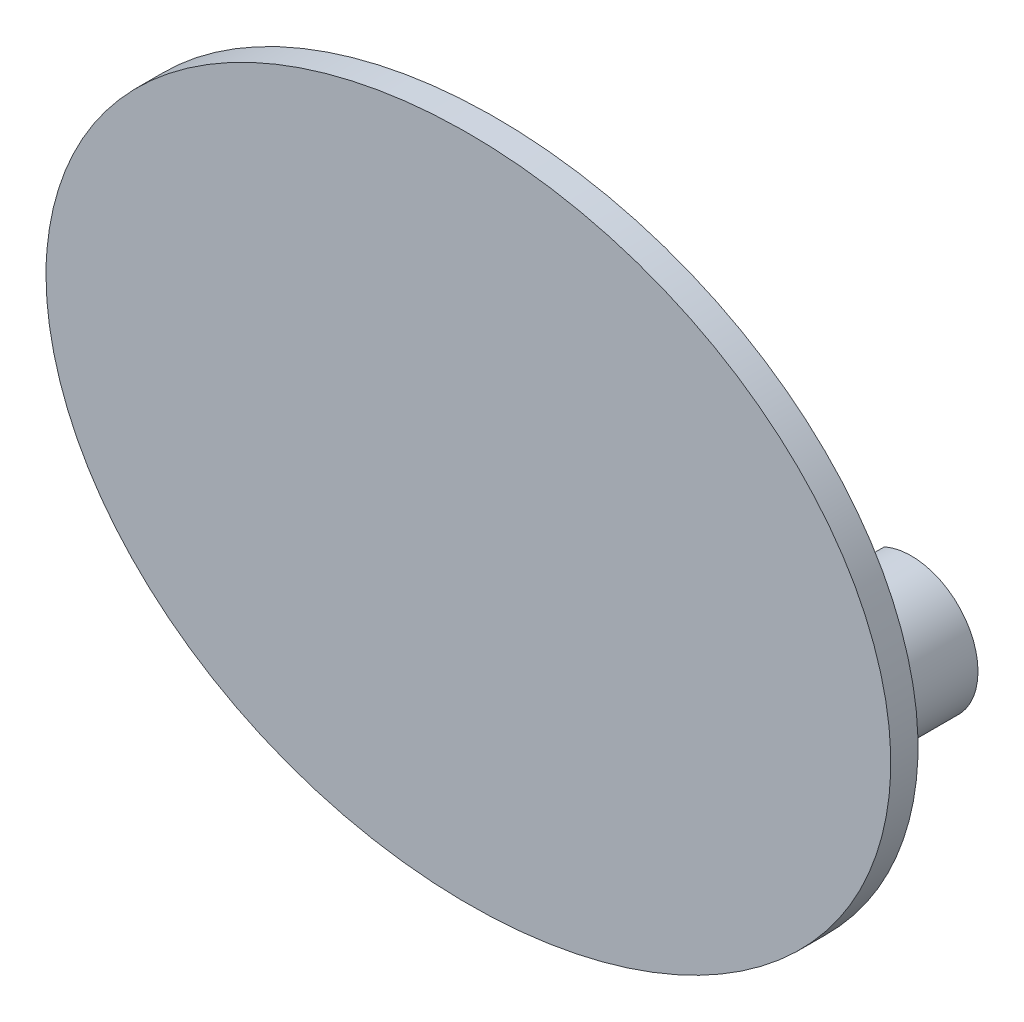
ISO-10303-21;
HEADER;
FILE_DESCRIPTION(('STEP AP214'),'2;1');
FILE_NAME('part.step','',(''),(''),'','','');
FILE_SCHEMA(('AUTOMOTIVE_DESIGN { 1 0 10303 214 1 1 1 1 }'));
ENDSEC;
DATA;
#1=APPLICATION_CONTEXT('core data for automotive mechanical design processes');
#2=APPLICATION_PROTOCOL_DEFINITION('international standard','automotive_design',2000,#1);
#3=PRODUCT_CONTEXT('',#1,'mechanical');
#4=PRODUCT('Part','Part','',(#3));
#5=PRODUCT_RELATED_PRODUCT_CATEGORY('part','',(#4));
#6=PRODUCT_DEFINITION_FORMATION('','',#4);
#7=PRODUCT_DEFINITION_CONTEXT('part definition',#1,'design');
#8=PRODUCT_DEFINITION('design','',#6,#7);
#9=PRODUCT_DEFINITION_SHAPE('','',#8);
#10=(LENGTH_UNIT() NAMED_UNIT(*) SI_UNIT(.MILLI.,.METRE.));
#11=(NAMED_UNIT(*) PLANE_ANGLE_UNIT() SI_UNIT($,.RADIAN.));
#12=(NAMED_UNIT(*) SI_UNIT($,.STERADIAN.) SOLID_ANGLE_UNIT());
#13=UNCERTAINTY_MEASURE_WITH_UNIT(LENGTH_MEASURE(1.E-05),#10,'distance_accuracy_value','');
#14=(GEOMETRIC_REPRESENTATION_CONTEXT(3) GLOBAL_UNCERTAINTY_ASSIGNED_CONTEXT((#13)) GLOBAL_UNIT_ASSIGNED_CONTEXT((#10,
#11,#12)) REPRESENTATION_CONTEXT('',''));
#15=CARTESIAN_POINT('',(0.,0.,0.));
#16=DIRECTION('',(0.,0.,1.));
#17=DIRECTION('',(1.,0.,0.));
#18=AXIS2_PLACEMENT_3D('',#15,#16,#17);
#19=CARTESIAN_POINT('',(0.,0.,-7.));
#20=DIRECTION('',(0.,0.,1.));
#21=DIRECTION('',(1.,0.,0.));
#22=AXIS2_PLACEMENT_3D('',#19,#20,#21);
#23=CYLINDRICAL_SURFACE('',#22,22.);
#24=DIRECTION('',(0.,0.,1.));
#25=VECTOR('',#24,1.);
#26=CARTESIAN_POINT('',(21.9863829787234,-0.773927330504451,-7.));
#27=LINE('',#26,#25);
#28=CARTESIAN_POINT('',(21.9863829787234,-0.773927330504452,-2.9));
#29=VERTEX_POINT('',#28);
#30=CARTESIAN_POINT('',(21.9863829787234,-0.773927330504452,0.));
#31=VERTEX_POINT('',#30);
#32=EDGE_CURVE('E362',#29,#31,#27,.T.);
#33=ORIENTED_EDGE('',*,*,#32,.F.);
#34=CARTESIAN_POINT('',(0.,0.,-2.9));
#35=DIRECTION('',(0.,0.,-1.));
#36=DIRECTION('',(-1.,0.,0.));
#37=AXIS2_PLACEMENT_3D('',#34,#35,#36);
#38=CIRCLE('',#37,22.);
#39=CARTESIAN_POINT('',(21.8080260454723,-2.89999999999999,-2.9));
#40=VERTEX_POINT('',#39);
#41=EDGE_CURVE('E270',#29,#40,#38,.T.);
#42=ORIENTED_EDGE('',*,*,#41,.T.);
#43=DIRECTION('',(0.,0.,1.));
#44=VECTOR('',#43,1.);
#45=CARTESIAN_POINT('',(21.8080260454723,-2.89999999999999,-7.));
#46=LINE('',#45,#44);
#47=CARTESIAN_POINT('',(21.8080260454723,-2.89999999999999,-5.4));
#48=VERTEX_POINT('',#47);
#49=EDGE_CURVE('E196',#48,#40,#46,.T.);
#50=ORIENTED_EDGE('',*,*,#49,.F.);
#51=CARTESIAN_POINT('',(0.,0.,-5.4));
#52=DIRECTION('',(0.,0.,-1.));
#53=DIRECTION('',(-1.,0.,0.));
#54=AXIS2_PLACEMENT_3D('',#51,#52,#53);
#55=CIRCLE('',#54,22.);
#56=CARTESIAN_POINT('',(21.9863829787234,-0.773927330504452,-5.4));
#57=VERTEX_POINT('',#56);
#58=EDGE_CURVE('E251',#57,#48,#55,.T.);
#59=ORIENTED_EDGE('',*,*,#58,.F.);
#60=CARTESIAN_POINT('',(21.9863829787234,-0.773927330504451,-7.));
#61=VERTEX_POINT('',#60);
#62=EDGE_CURVE('E357',#61,#57,#27,.T.);
#63=ORIENTED_EDGE('',*,*,#62,.F.);
#64=CARTESIAN_POINT('',(0.,0.,-7.));
#65=DIRECTION('',(0.,0.,-1.));
#66=DIRECTION('',(1.,0.,0.));
#67=AXIS2_PLACEMENT_3D('',#64,#65,#66);
#68=CIRCLE('',#67,22.);
#69=CARTESIAN_POINT('',(21.5370212765957,-4.48962298322054,-7.));
#70=VERTEX_POINT('',#69);
#71=EDGE_CURVE('E327',#61,#70,#68,.T.);
#72=ORIENTED_EDGE('',*,*,#71,.T.);
#73=DIRECTION('',(0.,0.,1.));
#74=VECTOR('',#73,1.);
#75=CARTESIAN_POINT('',(21.5370212765957,-4.48962298322054,-7.));
#76=LINE('',#75,#74);
#77=CARTESIAN_POINT('',(21.5370212765957,-4.48962298322054,0.));
#78=VERTEX_POINT('',#77);
#79=EDGE_CURVE('E344',#70,#78,#76,.T.);
#80=ORIENTED_EDGE('',*,*,#79,.T.);
#81=CARTESIAN_POINT('',(0.,0.,0.));
#82=DIRECTION('',(0.,0.,-1.));
#83=DIRECTION('',(1.,0.,0.));
#84=AXIS2_PLACEMENT_3D('',#81,#82,#83);
#85=CIRCLE('',#84,22.);
#86=EDGE_CURVE('E313',#31,#78,#85,.T.);
#87=ORIENTED_EDGE('',*,*,#86,.F.);
#88=EDGE_LOOP('',(#33,#42,#50,#59,#63,#72,#80,#87));
#89=FACE_BOUND('',#88,.T.);
#90=ADVANCED_FACE('F39',(#89),#23,.F.);
#91=CARTESIAN_POINT('',(23.5,0.,-7.));
#92=DIRECTION('',(0.,0.,1.));
#93=DIRECTION('',(1.,0.,0.));
#94=AXIS2_PLACEMENT_3D('',#91,#92,#93);
#95=CYLINDRICAL_SURFACE('',#94,1.7);
#96=DIRECTION('',(0.,0.,1.));
#97=VECTOR('',#96,1.);
#98=CARTESIAN_POINT('',(21.9863829787234,0.77392733050447,-7.));
#99=LINE('',#98,#97);
#100=CARTESIAN_POINT('',(21.9863829787234,0.77392733050447,-2.9));
#101=VERTEX_POINT('',#100);
#102=CARTESIAN_POINT('',(21.9863829787234,0.77392733050447,0.));
#103=VERTEX_POINT('',#102);
#104=EDGE_CURVE('E367',#101,#103,#99,.T.);
#105=ORIENTED_EDGE('',*,*,#104,.F.);
#106=CARTESIAN_POINT('',(23.5,0.,-2.9));
#107=DIRECTION('',(0.,0.,-1.));
#108=DIRECTION('',(-1.,0.,0.));
#109=AXIS2_PLACEMENT_3D('',#106,#107,#108);
#110=CIRCLE('',#109,1.7);
#111=EDGE_CURVE('E266',#101,#29,#110,.T.);
#112=ORIENTED_EDGE('',*,*,#111,.T.);
#113=ORIENTED_EDGE('',*,*,#32,.T.);
#114=CARTESIAN_POINT('',(23.5,0.,0.));
#115=DIRECTION('',(0.,0.,-1.));
#116=DIRECTION('',(1.,0.,0.));
#117=AXIS2_PLACEMENT_3D('',#114,#115,#116);
#118=CIRCLE('',#117,1.7);
#119=EDGE_CURVE('E332',#103,#31,#118,.T.);
#120=ORIENTED_EDGE('',*,*,#119,.F.);
#121=EDGE_LOOP('',(#105,#112,#113,#120));
#122=FACE_BOUND('',#121,.T.);
#123=ADVANCED_FACE('F442',(#122),#95,.F.);
#124=CARTESIAN_POINT('',(0.,0.,-7.));
#125=DIRECTION('',(0.,0.,1.));
#126=DIRECTION('',(1.,0.,0.));
#127=AXIS2_PLACEMENT_3D('',#124,#125,#126);
#128=CYLINDRICAL_SURFACE('',#127,22.);
#129=DIRECTION('',(0.,0.,1.));
#130=VECTOR('',#129,1.);
#131=CARTESIAN_POINT('',(21.8080260454723,2.90000000000001,-7.));
#132=LINE('',#131,#130);
#133=CARTESIAN_POINT('',(21.8080260454723,2.90000000000001,-2.9));
#134=VERTEX_POINT('',#133);
#135=CARTESIAN_POINT('',(21.8080260454723,2.90000000000001,-5.4));
#136=VERTEX_POINT('',#135);
#137=EDGE_CURVE('E273',#134,#136,#132,.F.);
#138=ORIENTED_EDGE('',*,*,#137,.F.);
#139=CARTESIAN_POINT('',(0.,0.,-2.9));
#140=DIRECTION('',(0.,0.,-1.));
#141=DIRECTION('',(-1.,0.,0.));
#142=AXIS2_PLACEMENT_3D('',#139,#140,#141);
#143=CIRCLE('',#142,22.);
#144=EDGE_CURVE('E262',#134,#101,#143,.T.);
#145=ORIENTED_EDGE('',*,*,#144,.T.);
#146=ORIENTED_EDGE('',*,*,#104,.T.);
#147=CARTESIAN_POINT('',(0.,0.,0.));
#148=DIRECTION('',(0.,0.,-1.));
#149=DIRECTION('',(1.,0.,0.));
#150=AXIS2_PLACEMENT_3D('',#147,#148,#149);
#151=CIRCLE('',#150,22.);
#152=CARTESIAN_POINT('',(21.5370212765957,4.48962298322056,0.));
#153=VERTEX_POINT('',#152);
#154=EDGE_CURVE('E350',#153,#103,#151,.T.);
#155=ORIENTED_EDGE('',*,*,#154,.F.);
#156=DIRECTION('',(0.,0.,1.));
#157=VECTOR('',#156,1.);
#158=CARTESIAN_POINT('',(21.5370212765957,4.48962298322055,-7.));
#159=LINE('',#158,#157);
#160=CARTESIAN_POINT('',(21.5370212765957,4.48962298322055,-7.));
#161=VERTEX_POINT('',#160);
#162=EDGE_CURVE('E368',#161,#153,#159,.T.);
#163=ORIENTED_EDGE('',*,*,#162,.F.);
#164=CARTESIAN_POINT('',(0.,0.,-7.));
#165=DIRECTION('',(0.,0.,-1.));
#166=DIRECTION('',(1.,0.,0.));
#167=AXIS2_PLACEMENT_3D('',#164,#165,#166);
#168=CIRCLE('',#167,22.);
#169=CARTESIAN_POINT('',(21.9863829787234,0.77392733050447,-7.));
#170=VERTEX_POINT('',#169);
#171=EDGE_CURVE('E336',#161,#170,#168,.T.);
#172=ORIENTED_EDGE('',*,*,#171,.T.);
#173=CARTESIAN_POINT('',(21.9863829787234,0.77392733050447,-5.4));
#174=VERTEX_POINT('',#173);
#175=EDGE_CURVE('E363',#170,#174,#99,.T.);
#176=ORIENTED_EDGE('',*,*,#175,.T.);
#177=CARTESIAN_POINT('',(0.,0.,-5.4));
#178=DIRECTION('',(0.,0.,-1.));
#179=DIRECTION('',(-1.,0.,0.));
#180=AXIS2_PLACEMENT_3D('',#177,#178,#179);
#181=CIRCLE('',#180,22.);
#182=EDGE_CURVE('E245',#136,#174,#181,.T.);
#183=ORIENTED_EDGE('',*,*,#182,.F.);
#184=EDGE_LOOP('',(#138,#145,#146,#155,#163,#172,#176,#183));
#185=FACE_BOUND('',#184,.T.);
#186=ADVANCED_FACE('F449',(#185),#128,.F.);
#187=CARTESIAN_POINT('',(0.,0.,-7.));
#188=DIRECTION('',(0.,0.,1.));
#189=DIRECTION('',(1.,0.,0.));
#190=AXIS2_PLACEMENT_3D('',#187,#188,#189);
#191=CYLINDRICAL_SURFACE('',#190,22.);
#192=DIRECTION('',(0.,0.,1.));
#193=VECTOR('',#192,1.);
#194=CARTESIAN_POINT('',(-21.8080260454723,-2.89999999999999,-7.));
#195=LINE('',#194,#193);
#196=CARTESIAN_POINT('',(-21.8080260454723,-2.89999999999999,-2.9));
#197=VERTEX_POINT('',#196);
#198=CARTESIAN_POINT('',(-21.8080260454723,-2.89999999999999,-5.4));
#199=VERTEX_POINT('',#198);
#200=EDGE_CURVE('E11',#197,#199,#195,.F.);
#201=ORIENTED_EDGE('',*,*,#200,.F.);
#202=CARTESIAN_POINT('',(0.,0.,-2.9));
#203=DIRECTION('',(0.,0.,-1.));
#204=DIRECTION('',(-1.,0.,0.));
#205=AXIS2_PLACEMENT_3D('',#202,#203,#204);
#206=CIRCLE('',#205,22.);
#207=CARTESIAN_POINT('',(-21.9863829787234,-0.773927330504434,-2.9));
#208=VERTEX_POINT('',#207);
#209=EDGE_CURVE('E258',#197,#208,#206,.T.);
#210=ORIENTED_EDGE('',*,*,#209,.T.);
#211=DIRECTION('',(0.,0.,1.));
#212=VECTOR('',#211,1.);
#213=CARTESIAN_POINT('',(-21.9863829787234,-0.773927330504434,-7.));
#214=LINE('',#213,#212);
#215=CARTESIAN_POINT('',(-21.9863829787234,-0.773927330504434,0.));
#216=VERTEX_POINT('',#215);
#217=EDGE_CURVE('E296',#208,#216,#214,.T.);
#218=ORIENTED_EDGE('',*,*,#217,.T.);
#219=CARTESIAN_POINT('',(0.,0.,0.));
#220=DIRECTION('',(0.,0.,-1.));
#221=DIRECTION('',(1.,0.,0.));
#222=AXIS2_PLACEMENT_3D('',#219,#220,#221);
#223=CIRCLE('',#222,22.);
#224=CARTESIAN_POINT('',(-21.5370212765958,-4.48962298322055,0.));
#225=VERTEX_POINT('',#224);
#226=EDGE_CURVE('E278',#225,#216,#223,.T.);
#227=ORIENTED_EDGE('',*,*,#226,.F.);
#228=DIRECTION('',(0.,0.,1.));
#229=VECTOR('',#228,1.);
#230=CARTESIAN_POINT('',(-21.5370212765958,-4.48962298322055,-7.));
#231=LINE('',#230,#229);
#232=CARTESIAN_POINT('',(-21.5370212765958,-4.48962298322055,-7.));
#233=VERTEX_POINT('',#232);
#234=EDGE_CURVE('E309',#233,#225,#231,.T.);
#235=ORIENTED_EDGE('',*,*,#234,.F.);
#236=CARTESIAN_POINT('',(0.,0.,-7.));
#237=DIRECTION('',(0.,0.,-1.));
#238=DIRECTION('',(1.,0.,0.));
#239=AXIS2_PLACEMENT_3D('',#236,#237,#238);
#240=CIRCLE('',#239,22.);
#241=CARTESIAN_POINT('',(-21.9863829787234,-0.773927330504434,-7.));
#242=VERTEX_POINT('',#241);
#243=EDGE_CURVE('E279',#233,#242,#240,.T.);
#244=ORIENTED_EDGE('',*,*,#243,.T.);
#245=CARTESIAN_POINT('',(-21.9863829787234,-0.773927330504434,-5.4));
#246=VERTEX_POINT('',#245);
#247=EDGE_CURVE('E323',#242,#246,#214,.T.);
#248=ORIENTED_EDGE('',*,*,#247,.T.);
#249=CARTESIAN_POINT('',(0.,0.,-5.4));
#250=DIRECTION('',(0.,0.,-1.));
#251=DIRECTION('',(-1.,0.,0.));
#252=AXIS2_PLACEMENT_3D('',#249,#250,#251);
#253=CIRCLE('',#252,22.);
#254=EDGE_CURVE('E64',#199,#246,#253,.T.);
#255=ORIENTED_EDGE('',*,*,#254,.F.);
#256=EDGE_LOOP('',(#201,#210,#218,#227,#235,#244,#248,#255));
#257=FACE_BOUND('',#256,.T.);
#258=ADVANCED_FACE('F421',(#257),#191,.F.);
#259=CARTESIAN_POINT('',(0.,0.,-7.));
#260=DIRECTION('',(0.,0.,1.));
#261=DIRECTION('',(1.,0.,0.));
#262=AXIS2_PLACEMENT_3D('',#259,#260,#261);
#263=CYLINDRICAL_SURFACE('',#262,22.);
#264=DIRECTION('',(0.,0.,1.));
#265=VECTOR('',#264,1.);
#266=CARTESIAN_POINT('',(-21.9863829787234,0.773927330504431,-7.));
#267=LINE('',#266,#265);
#268=CARTESIAN_POINT('',(-21.9863829787234,0.773927330504431,-2.9));
#269=VERTEX_POINT('',#268);
#270=CARTESIAN_POINT('',(-21.9863829787234,0.773927330504431,0.));
#271=VERTEX_POINT('',#270);
#272=EDGE_CURVE('E322',#269,#271,#267,.T.);
#273=ORIENTED_EDGE('',*,*,#272,.F.);
#274=CARTESIAN_POINT('',(0.,0.,-2.9));
#275=DIRECTION('',(0.,0.,-1.));
#276=DIRECTION('',(-1.,0.,0.));
#277=AXIS2_PLACEMENT_3D('',#274,#275,#276);
#278=CIRCLE('',#277,22.);
#279=CARTESIAN_POINT('',(-21.8080260454723,2.90000000000001,-2.9));
#280=VERTEX_POINT('',#279);
#281=EDGE_CURVE('E254',#269,#280,#278,.T.);
#282=ORIENTED_EDGE('',*,*,#281,.T.);
#283=DIRECTION('',(0.,0.,1.));
#284=VECTOR('',#283,1.);
#285=CARTESIAN_POINT('',(-21.8080260454723,2.90000000000001,-7.));
#286=LINE('',#285,#284);
#287=CARTESIAN_POINT('',(-21.8080260454723,2.90000000000001,-5.4));
#288=VERTEX_POINT('',#287);
#289=EDGE_CURVE('E49',#288,#280,#286,.T.);
#290=ORIENTED_EDGE('',*,*,#289,.F.);
#291=CARTESIAN_POINT('',(0.,0.,-5.4));
#292=DIRECTION('',(0.,0.,-1.));
#293=DIRECTION('',(-1.,0.,0.));
#294=AXIS2_PLACEMENT_3D('',#291,#292,#293);
#295=CIRCLE('',#294,22.);
#296=CARTESIAN_POINT('',(-21.9863829787234,0.773927330504431,-5.4));
#297=VERTEX_POINT('',#296);
#298=EDGE_CURVE('E234',#297,#288,#295,.T.);
#299=ORIENTED_EDGE('',*,*,#298,.F.);
#300=CARTESIAN_POINT('',(-21.9863829787234,0.773927330504431,-7.));
#301=VERTEX_POINT('',#300);
#302=EDGE_CURVE('E318',#301,#297,#267,.T.);
#303=ORIENTED_EDGE('',*,*,#302,.F.);
#304=CARTESIAN_POINT('',(0.,0.,-7.));
#305=DIRECTION('',(0.,0.,-1.));
#306=DIRECTION('',(1.,0.,0.));
#307=AXIS2_PLACEMENT_3D('',#304,#305,#306);
#308=CIRCLE('',#307,22.);
#309=CARTESIAN_POINT('',(-21.5370212765958,4.48962298322054,-7.));
#310=VERTEX_POINT('',#309);
#311=EDGE_CURVE('E288',#301,#310,#308,.T.);
#312=ORIENTED_EDGE('',*,*,#311,.T.);
#313=DIRECTION('',(0.,0.,1.));
#314=VECTOR('',#313,1.);
#315=CARTESIAN_POINT('',(-21.5370212765958,4.48962298322054,-7.));
#316=LINE('',#315,#314);
#317=CARTESIAN_POINT('',(-21.5370212765958,4.48962298322054,0.));
#318=VERTEX_POINT('',#317);
#319=EDGE_CURVE('E314',#310,#318,#316,.T.);
#320=ORIENTED_EDGE('',*,*,#319,.T.);
#321=CARTESIAN_POINT('',(0.,0.,0.));
#322=DIRECTION('',(0.,0.,-1.));
#323=DIRECTION('',(1.,0.,0.));
#324=AXIS2_PLACEMENT_3D('',#321,#322,#323);
#325=CIRCLE('',#324,22.);
#326=EDGE_CURVE('E304',#271,#318,#325,.T.);
#327=ORIENTED_EDGE('',*,*,#326,.F.);
#328=EDGE_LOOP('',(#273,#282,#290,#299,#303,#312,#320,#327));
#329=FACE_BOUND('',#328,.T.);
#330=ADVANCED_FACE('F410',(#329),#263,.F.);
#331=CARTESIAN_POINT('',(-23.5,0.,-7.));
#332=DIRECTION('',(0.,0.,1.));
#333=DIRECTION('',(1.,0.,0.));
#334=AXIS2_PLACEMENT_3D('',#331,#332,#333);
#335=CYLINDRICAL_SURFACE('',#334,1.69999999999998);
#336=ORIENTED_EDGE('',*,*,#217,.F.);
#337=CARTESIAN_POINT('',(-23.5,0.,-2.9));
#338=DIRECTION('',(0.,0.,-1.));
#339=DIRECTION('',(-1.,0.,0.));
#340=AXIS2_PLACEMENT_3D('',#337,#338,#339);
#341=CIRCLE('',#340,1.69999999999998);
#342=EDGE_CURVE('E395',#208,#269,#341,.T.);
#343=ORIENTED_EDGE('',*,*,#342,.T.);
#344=ORIENTED_EDGE('',*,*,#272,.T.);
#345=CARTESIAN_POINT('',(-23.5,0.,0.));
#346=DIRECTION('',(0.,0.,-1.));
#347=DIRECTION('',(1.,0.,0.));
#348=AXIS2_PLACEMENT_3D('',#345,#346,#347);
#349=CIRCLE('',#348,1.69999999999998);
#350=EDGE_CURVE('E300',#216,#271,#349,.T.);
#351=ORIENTED_EDGE('',*,*,#350,.F.);
#352=EDGE_LOOP('',(#336,#343,#344,#351));
#353=FACE_BOUND('',#352,.T.);
#354=ADVANCED_FACE('F425',(#353),#335,.F.);
#355=CARTESIAN_POINT('',(31.,0.,0.));
#356=DIRECTION('',(0.,0.,-1.));
#357=DIRECTION('',(-1.,0.,0.));
#358=AXIS2_PLACEMENT_3D('',#355,#356,#357);
#359=PLANE('',#358);
#360=CARTESIAN_POINT('',(-31.,0.,0.));
#361=CARTESIAN_POINT('',(-31.,-3.36634659169575,0.));
#362=CARTESIAN_POINT('',(-29.2060760589558,-10.0990397750872,0.));
#363=CARTESIAN_POINT('',(-22.0158701328041,-18.1678971581392,0.));
#364=CARTESIAN_POINT('',(-11.7947637266437,-23.318217270695,0.));
#365=CARTESIAN_POINT('',(0.,-25.0908913646525,0.));
#366=CARTESIAN_POINT('',(11.7947637266437,-23.318217270695,0.));
#367=CARTESIAN_POINT('',(22.0158701328041,-18.1678971581392,0.));
#368=CARTESIAN_POINT('',(29.2060760589558,-10.0990397750872,0.));
#369=CARTESIAN_POINT('',(31.8969619705221,0.,0.));
#370=CARTESIAN_POINT('',(29.2060760589558,10.0990397750872,0.));
#371=CARTESIAN_POINT('',(22.0158701328041,18.1678971581392,0.));
#372=CARTESIAN_POINT('',(11.7947637266437,23.318217270695,0.));
#373=CARTESIAN_POINT('',(0.,25.0908913646525,0.));
#374=CARTESIAN_POINT('',(-11.7947637266437,23.318217270695,0.));
#375=CARTESIAN_POINT('',(-22.0158701328041,18.1678971581392,0.));
#376=CARTESIAN_POINT('',(-29.2060760589558,10.0990397750872,0.));
#377=CARTESIAN_POINT('',(-31.,3.36634659169575,0.));
#378=CARTESIAN_POINT('',(-31.,0.,0.));
#379=B_SPLINE_CURVE_WITH_KNOTS('',3,(#360,#361,#362,#363,#364,#365,#366,#367,#368,#369,#370,
#371,#372,#373,#374,#375,#376,#377,#378),.UNSPECIFIED.,.T.,.F.,(4,1,1,1,1,1,1,1,1,1,1,1,1,1,1,1,
4),(0.,0.392699081698724,0.785398163397448,1.17809724509617,1.5707963267949,1.96349540849362,
2.35619449019234,2.74889357189107,3.14159265358979,3.53429173528852,3.92699081698724,
4.31968989868597,4.71238898038469,5.10508806208341,5.49778714378214,5.89048622548086,
6.28318530717959),.UNSPECIFIED.);
#380=CARTESIAN_POINT('',(-31.,0.,0.));
#381=VERTEX_POINT('',#380);
#382=EDGE_CURVE('E361',#381,#381,#379,.T.);
#383=ORIENTED_EDGE('',*,*,#382,.F.);
#384=EDGE_LOOP('',(#383));
#385=FACE_BOUND('',#384,.T.);
#386=ORIENTED_EDGE('',*,*,#86,.T.);
#387=CARTESIAN_POINT('',(23.5,0.,0.));
#388=DIRECTION('',(0.,0.,1.));
#389=DIRECTION('',(1.,0.,0.));
#390=AXIS2_PLACEMENT_3D('',#387,#388,#389);
#391=CIRCLE('',#390,4.9);
#392=EDGE_CURVE('E347',#78,#153,#391,.T.);
#393=ORIENTED_EDGE('',*,*,#392,.T.);
#394=ORIENTED_EDGE('',*,*,#154,.T.);
#395=ORIENTED_EDGE('',*,*,#119,.T.);
#396=EDGE_LOOP('',(#386,#393,#394,#395));
#397=FACE_BOUND('',#396,.T.);
#398=ORIENTED_EDGE('',*,*,#226,.T.);
#399=ORIENTED_EDGE('',*,*,#350,.T.);
#400=ORIENTED_EDGE('',*,*,#326,.T.);
#401=CARTESIAN_POINT('',(-23.5,0.,0.));
#402=DIRECTION('',(0.,0.,1.));
#403=DIRECTION('',(1.,0.,0.));
#404=AXIS2_PLACEMENT_3D('',#401,#402,#403);
#405=CIRCLE('',#404,4.9);
#406=EDGE_CURVE('E284',#318,#225,#405,.T.);
#407=ORIENTED_EDGE('',*,*,#406,.T.);
#408=EDGE_LOOP('',(#398,#399,#400,#407));
#409=FACE_BOUND('',#408,.T.);
#410=ADVANCED_FACE('F423',(#385,#397,#409),#359,.T.);
#411=CARTESIAN_POINT('',(-31.,0.,2.));
#412=CARTESIAN_POINT('',(-31.,-3.36634659169575,2.));
#413=CARTESIAN_POINT('',(-29.2060760589558,-10.0990397750872,2.));
#414=CARTESIAN_POINT('',(-22.0158701328041,-18.1678971581392,2.));
#415=CARTESIAN_POINT('',(-11.7947637266437,-23.318217270695,2.));
#416=CARTESIAN_POINT('',(0.,-25.0908913646525,2.));
#417=CARTESIAN_POINT('',(11.7947637266437,-23.318217270695,2.));
#418=CARTESIAN_POINT('',(22.0158701328041,-18.1678971581392,2.));
#419=CARTESIAN_POINT('',(29.2060760589558,-10.0990397750872,2.));
#420=CARTESIAN_POINT('',(31.8969619705221,0.,2.));
#421=CARTESIAN_POINT('',(29.2060760589558,10.0990397750872,2.));
#422=CARTESIAN_POINT('',(22.0158701328041,18.1678971581392,2.));
#423=CARTESIAN_POINT('',(11.7947637266437,23.318217270695,2.));
#424=CARTESIAN_POINT('',(0.,25.0908913646525,2.));
#425=CARTESIAN_POINT('',(-11.7947637266437,23.318217270695,2.));
#426=CARTESIAN_POINT('',(-22.0158701328041,18.1678971581392,2.));
#427=CARTESIAN_POINT('',(-29.2060760589558,10.0990397750872,2.));
#428=CARTESIAN_POINT('',(-31.,3.36634659169575,2.));
#429=CARTESIAN_POINT('',(-31.,0.,2.));
#430=B_SPLINE_CURVE_WITH_KNOTS('',3,(#411,#412,#413,#414,#415,#416,#417,#418,#419,#420,#421,
#422,#423,#424,#425,#426,#427,#428,#429),.UNSPECIFIED.,.T.,.F.,(4,1,1,1,1,1,1,1,1,1,1,1,1,1,1,1,
4),(0.,0.392699081698724,0.785398163397448,1.17809724509617,1.5707963267949,1.96349540849362,
2.35619449019234,2.74889357189107,3.14159265358979,3.53429173528852,3.92699081698724,
4.31968989868597,4.71238898038469,5.10508806208341,5.49778714378214,5.89048622548086,
6.28318530717959),.UNSPECIFIED.);
#431=DIRECTION('',(0.,0.,-1.));
#432=VECTOR('',#431,1.);
#433=SURFACE_OF_LINEAR_EXTRUSION('',#430,#432);
#434=CARTESIAN_POINT('',(-31.,0.,2.));
#435=VERTEX_POINT('',#434);
#436=EDGE_CURVE('E374',#435,#435,#430,.T.);
#437=ORIENTED_EDGE('',*,*,#436,.F.);
#438=EDGE_LOOP('',(#437));
#439=FACE_BOUND('',#438,.T.);
#440=ORIENTED_EDGE('',*,*,#382,.T.);
#441=EDGE_LOOP('',(#440));
#442=FACE_BOUND('',#441,.T.);
#443=ADVANCED_FACE('F41',(#439,#442),#433,.F.);
#444=CARTESIAN_POINT('',(31.,0.,2.));
#445=DIRECTION('',(0.,0.,-1.));
#446=DIRECTION('',(-1.,0.,0.));
#447=AXIS2_PLACEMENT_3D('',#444,#445,#446);
#448=PLANE('',#447);
#449=ORIENTED_EDGE('',*,*,#436,.T.);
#450=EDGE_LOOP('',(#449));
#451=FACE_BOUND('',#450,.T.);
#452=ADVANCED_FACE('F458',(#451),#448,.F.);
#453=CARTESIAN_POINT('',(23.5,0.,-5.4));
#454=DIRECTION('',(0.,0.,-1.));
#455=DIRECTION('',(-1.,0.,0.));
#456=AXIS2_PLACEMENT_3D('',#453,#454,#455);
#457=CIRCLE('',#456,1.7);
#458=EDGE_CURVE('E248',#174,#57,#457,.T.);
#459=ORIENTED_EDGE('',*,*,#458,.F.);
#460=ORIENTED_EDGE('',*,*,#175,.F.);
#461=CARTESIAN_POINT('',(23.5,0.,-7.));
#462=DIRECTION('',(0.,0.,-1.));
#463=DIRECTION('',(1.,0.,0.));
#464=AXIS2_PLACEMENT_3D('',#461,#462,#463);
#465=CIRCLE('',#464,1.7);
#466=EDGE_CURVE('E340',#170,#61,#465,.T.);
#467=ORIENTED_EDGE('',*,*,#466,.T.);
#468=ORIENTED_EDGE('',*,*,#62,.T.);
#469=EDGE_LOOP('',(#459,#460,#467,#468));
#470=FACE_BOUND('',#469,.T.);
#471=ADVANCED_FACE('F452',(#470),#95,.F.);
#472=CARTESIAN_POINT('',(23.5,0.,-7.));
#473=DIRECTION('',(0.,0.,1.));
#474=DIRECTION('',(1.,0.,0.));
#475=AXIS2_PLACEMENT_3D('',#472,#473,#474);
#476=CYLINDRICAL_SURFACE('',#475,4.9);
#477=ORIENTED_EDGE('',*,*,#392,.F.);
#478=ORIENTED_EDGE('',*,*,#79,.F.);
#479=CARTESIAN_POINT('',(23.5,0.,-7.));
#480=DIRECTION('',(0.,0.,1.));
#481=DIRECTION('',(1.,0.,0.));
#482=AXIS2_PLACEMENT_3D('',#479,#480,#481);
#483=CIRCLE('',#482,4.9);
#484=EDGE_CURVE('E331',#70,#161,#483,.T.);
#485=ORIENTED_EDGE('',*,*,#484,.T.);
#486=ORIENTED_EDGE('',*,*,#162,.T.);
#487=EDGE_LOOP('',(#477,#478,#485,#486));
#488=FACE_BOUND('',#487,.T.);
#489=ADVANCED_FACE('F456',(#488),#476,.T.);
#490=CARTESIAN_POINT('',(11.75,0.,-7.));
#491=DIRECTION('',(0.,0.,1.));
#492=DIRECTION('',(1.,0.,0.));
#493=AXIS2_PLACEMENT_3D('',#490,#491,#492);
#494=PLANE('',#493);
#495=ORIENTED_EDGE('',*,*,#71,.F.);
#496=ORIENTED_EDGE('',*,*,#466,.F.);
#497=ORIENTED_EDGE('',*,*,#171,.F.);
#498=ORIENTED_EDGE('',*,*,#484,.F.);
#499=EDGE_LOOP('',(#495,#496,#497,#498));
#500=FACE_BOUND('',#499,.T.);
#501=ADVANCED_FACE('F491',(#500),#494,.F.);
#502=CARTESIAN_POINT('',(-23.5,0.,-7.));
#503=DIRECTION('',(0.,0.,1.));
#504=DIRECTION('',(1.,0.,0.));
#505=AXIS2_PLACEMENT_3D('',#502,#503,#504);
#506=CYLINDRICAL_SURFACE('',#505,4.9);
#507=ORIENTED_EDGE('',*,*,#406,.F.);
#508=ORIENTED_EDGE('',*,*,#319,.F.);
#509=CARTESIAN_POINT('',(-23.5,0.,-7.));
#510=DIRECTION('',(0.,0.,1.));
#511=DIRECTION('',(1.,0.,0.));
#512=AXIS2_PLACEMENT_3D('',#509,#510,#511);
#513=CIRCLE('',#512,4.9);
#514=EDGE_CURVE('E292',#310,#233,#513,.T.);
#515=ORIENTED_EDGE('',*,*,#514,.T.);
#516=ORIENTED_EDGE('',*,*,#234,.T.);
#517=EDGE_LOOP('',(#507,#508,#515,#516));
#518=FACE_BOUND('',#517,.T.);
#519=ADVANCED_FACE('F439',(#518),#506,.T.);
#520=CARTESIAN_POINT('',(-23.5,0.,-5.4));
#521=DIRECTION('',(0.,0.,-1.));
#522=DIRECTION('',(-1.,0.,0.));
#523=AXIS2_PLACEMENT_3D('',#520,#521,#522);
#524=CIRCLE('',#523,1.69999999999998);
#525=EDGE_CURVE('E381',#246,#297,#524,.T.);
#526=ORIENTED_EDGE('',*,*,#525,.F.);
#527=ORIENTED_EDGE('',*,*,#247,.F.);
#528=CARTESIAN_POINT('',(-23.5,0.,-7.));
#529=DIRECTION('',(0.,0.,-1.));
#530=DIRECTION('',(1.,0.,0.));
#531=AXIS2_PLACEMENT_3D('',#528,#529,#530);
#532=CIRCLE('',#531,1.69999999999998);
#533=EDGE_CURVE('E283',#242,#301,#532,.T.);
#534=ORIENTED_EDGE('',*,*,#533,.T.);
#535=ORIENTED_EDGE('',*,*,#302,.T.);
#536=EDGE_LOOP('',(#526,#527,#534,#535));
#537=FACE_BOUND('',#536,.T.);
#538=ADVANCED_FACE('F428',(#537),#335,.F.);
#539=CARTESIAN_POINT('',(-11.75,0.,-7.));
#540=DIRECTION('',(0.,0.,1.));
#541=DIRECTION('',(1.,0.,0.));
#542=AXIS2_PLACEMENT_3D('',#539,#540,#541);
#543=PLANE('',#542);
#544=ORIENTED_EDGE('',*,*,#243,.F.);
#545=ORIENTED_EDGE('',*,*,#514,.F.);
#546=ORIENTED_EDGE('',*,*,#311,.F.);
#547=ORIENTED_EDGE('',*,*,#533,.F.);
#548=EDGE_LOOP('',(#544,#545,#546,#547));
#549=FACE_BOUND('',#548,.T.);
#550=ADVANCED_FACE('F438',(#549),#543,.F.);
#551=CARTESIAN_POINT('',(-24.5,0.,-2.9));
#552=DIRECTION('',(0.,0.,-1.));
#553=DIRECTION('',(-1.,0.,0.));
#554=AXIS2_PLACEMENT_3D('',#551,#552,#553);
#555=CYLINDRICAL_SURFACE('',#554,2.9);
#556=CARTESIAN_POINT('',(-24.5,0.,-5.4));
#557=DIRECTION('',(0.,0.,-1.));
#558=DIRECTION('',(-1.,0.,0.));
#559=AXIS2_PLACEMENT_3D('',#556,#557,#558);
#560=CIRCLE('',#559,2.9);
#561=CARTESIAN_POINT('',(-24.5,-2.89999999999999,-5.4));
#562=VERTEX_POINT('',#561);
#563=CARTESIAN_POINT('',(-24.5,2.90000000000001,-5.4));
#564=VERTEX_POINT('',#563);
#565=EDGE_CURVE('E227',#562,#564,#560,.T.);
#566=ORIENTED_EDGE('',*,*,#565,.T.);
#567=DIRECTION('',(0.,0.,-1.));
#568=VECTOR('',#567,1.);
#569=CARTESIAN_POINT('',(-24.5,2.90000000000001,-2.9));
#570=LINE('',#569,#568);
#571=CARTESIAN_POINT('',(-24.5,2.90000000000001,-2.9));
#572=VERTEX_POINT('',#571);
#573=EDGE_CURVE('E235',#572,#564,#570,.T.);
#574=ORIENTED_EDGE('',*,*,#573,.F.);
#575=CARTESIAN_POINT('',(-24.5,0.,-2.9));
#576=DIRECTION('',(0.,0.,-1.));
#577=DIRECTION('',(-1.,0.,0.));
#578=AXIS2_PLACEMENT_3D('',#575,#576,#577);
#579=CIRCLE('',#578,2.9);
#580=CARTESIAN_POINT('',(-24.5,-2.89999999999999,-2.9));
#581=VERTEX_POINT('',#580);
#582=EDGE_CURVE('E200',#581,#572,#579,.T.);
#583=ORIENTED_EDGE('',*,*,#582,.F.);
#584=DIRECTION('',(0.,0.,-1.));
#585=VECTOR('',#584,1.);
#586=CARTESIAN_POINT('',(-24.5,-2.89999999999999,-2.9));
#587=LINE('',#586,#585);
#588=EDGE_CURVE('E189',#581,#562,#587,.T.);
#589=ORIENTED_EDGE('',*,*,#588,.T.);
#590=EDGE_LOOP('',(#566,#574,#583,#589));
#591=FACE_BOUND('',#590,.T.);
#592=ADVANCED_FACE('F537',(#591),#555,.F.);
#593=CARTESIAN_POINT('',(24.5,0.,-2.9));
#594=DIRECTION('',(0.,0.,-1.));
#595=DIRECTION('',(-1.,0.,0.));
#596=AXIS2_PLACEMENT_3D('',#593,#594,#595);
#597=PLANE('',#596);
#598=DIRECTION('',(-1.,0.,0.));
#599=VECTOR('',#598,1.);
#600=CARTESIAN_POINT('',(24.5,-2.89999999999999,-2.9));
#601=LINE('',#600,#599);
#602=EDGE_CURVE('E201',#197,#581,#601,.T.);
#603=ORIENTED_EDGE('',*,*,#602,.T.);
#604=ORIENTED_EDGE('',*,*,#582,.T.);
#605=DIRECTION('',(1.,0.,0.));
#606=VECTOR('',#605,1.);
#607=CARTESIAN_POINT('',(24.5,2.90000000000001,-2.9));
#608=LINE('',#607,#606);
#609=EDGE_CURVE('E190',#572,#280,#608,.T.);
#610=ORIENTED_EDGE('',*,*,#609,.T.);
#611=ORIENTED_EDGE('',*,*,#281,.F.);
#612=ORIENTED_EDGE('',*,*,#342,.F.);
#613=ORIENTED_EDGE('',*,*,#209,.F.);
#614=EDGE_LOOP('',(#603,#604,#610,#611,#612,#613));
#615=FACE_BOUND('',#614,.T.);
#616=ADVANCED_FACE('F407',(#615),#597,.T.);
#617=CARTESIAN_POINT('',(24.5,0.,-5.4));
#618=DIRECTION('',(0.,0.,-1.));
#619=DIRECTION('',(-1.,0.,0.));
#620=AXIS2_PLACEMENT_3D('',#617,#618,#619);
#621=PLANE('',#620);
#622=ORIENTED_EDGE('',*,*,#254,.T.);
#623=ORIENTED_EDGE('',*,*,#525,.T.);
#624=ORIENTED_EDGE('',*,*,#298,.T.);
#625=DIRECTION('',(1.,0.,0.));
#626=VECTOR('',#625,1.);
#627=CARTESIAN_POINT('',(24.5,2.90000000000001,-5.4));
#628=LINE('',#627,#626);
#629=EDGE_CURVE('E208',#564,#288,#628,.T.);
#630=ORIENTED_EDGE('',*,*,#629,.F.);
#631=ORIENTED_EDGE('',*,*,#565,.F.);
#632=DIRECTION('',(-1.,0.,0.));
#633=VECTOR('',#632,1.);
#634=CARTESIAN_POINT('',(24.5,-2.89999999999999,-5.4));
#635=LINE('',#634,#633);
#636=EDGE_CURVE('E223',#199,#562,#635,.T.);
#637=ORIENTED_EDGE('',*,*,#636,.F.);
#638=EDGE_LOOP('',(#622,#623,#624,#630,#631,#637));
#639=FACE_BOUND('',#638,.T.);
#640=ADVANCED_FACE('F552',(#639),#621,.F.);
#641=CARTESIAN_POINT('',(24.5,2.90000000000001,-2.9));
#642=DIRECTION('',(0.,1.,0.));
#643=DIRECTION('',(0.,0.,1.));
#644=AXIS2_PLACEMENT_3D('',#641,#642,#643);
#645=PLANE('',#644);
#646=ORIENTED_EDGE('',*,*,#289,.T.);
#647=ORIENTED_EDGE('',*,*,#609,.F.);
#648=ORIENTED_EDGE('',*,*,#573,.T.);
#649=ORIENTED_EDGE('',*,*,#629,.T.);
#650=EDGE_LOOP('',(#646,#647,#648,#649));
#651=FACE_BOUND('',#650,.T.);
#652=ADVANCED_FACE('F402',(#651),#645,.F.);
#653=CARTESIAN_POINT('',(24.5,-2.89999999999999,-2.9));
#654=DIRECTION('',(0.,-1.,0.));
#655=DIRECTION('',(0.,0.,-1.));
#656=AXIS2_PLACEMENT_3D('',#653,#654,#655);
#657=PLANE('',#656);
#658=ORIENTED_EDGE('',*,*,#200,.T.);
#659=ORIENTED_EDGE('',*,*,#636,.T.);
#660=ORIENTED_EDGE('',*,*,#588,.F.);
#661=ORIENTED_EDGE('',*,*,#602,.F.);
#662=EDGE_LOOP('',(#658,#659,#660,#661));
#663=FACE_BOUND('',#662,.T.);
#664=ADVANCED_FACE('F569',(#663),#657,.F.);
#665=ORIENTED_EDGE('',*,*,#49,.T.);
#666=CARTESIAN_POINT('',(24.5,-2.89999999999999,-2.9));
#667=VERTEX_POINT('',#666);
#668=EDGE_CURVE('E193',#667,#40,#601,.T.);
#669=ORIENTED_EDGE('',*,*,#668,.F.);
#670=DIRECTION('',(0.,0.,-1.));
#671=VECTOR('',#670,1.);
#672=CARTESIAN_POINT('',(24.5,-2.89999999999999,-2.9));
#673=LINE('',#672,#671);
#674=CARTESIAN_POINT('',(24.5,-2.89999999999999,-5.4));
#675=VERTEX_POINT('',#674);
#676=EDGE_CURVE('E178',#667,#675,#673,.T.);
#677=ORIENTED_EDGE('',*,*,#676,.T.);
#678=EDGE_CURVE('E224',#675,#48,#635,.T.);
#679=ORIENTED_EDGE('',*,*,#678,.T.);
#680=EDGE_LOOP('',(#665,#669,#677,#679));
#681=FACE_BOUND('',#680,.T.);
#682=ADVANCED_FACE('F194',(#681),#657,.F.);
#683=ORIENTED_EDGE('',*,*,#137,.T.);
#684=CARTESIAN_POINT('',(24.5,2.90000000000001,-5.4));
#685=VERTEX_POINT('',#684);
#686=EDGE_CURVE('E56',#136,#685,#628,.T.);
#687=ORIENTED_EDGE('',*,*,#686,.T.);
#688=DIRECTION('',(0.,0.,-1.));
#689=VECTOR('',#688,1.);
#690=CARTESIAN_POINT('',(24.5,2.90000000000001,-2.9));
#691=LINE('',#690,#689);
#692=CARTESIAN_POINT('',(24.5,2.90000000000001,-2.9));
#693=VERTEX_POINT('',#692);
#694=EDGE_CURVE('E231',#693,#685,#691,.T.);
#695=ORIENTED_EDGE('',*,*,#694,.F.);
#696=EDGE_CURVE('E205',#134,#693,#608,.T.);
#697=ORIENTED_EDGE('',*,*,#696,.F.);
#698=EDGE_LOOP('',(#683,#687,#695,#697));
#699=FACE_BOUND('',#698,.T.);
#700=ADVANCED_FACE('F486',(#699),#645,.F.);
#701=ORIENTED_EDGE('',*,*,#111,.F.);
#702=ORIENTED_EDGE('',*,*,#144,.F.);
#703=ORIENTED_EDGE('',*,*,#696,.T.);
#704=CARTESIAN_POINT('',(24.5,0.,-2.9));
#705=DIRECTION('',(0.,0.,-1.));
#706=DIRECTION('',(-1.,0.,0.));
#707=AXIS2_PLACEMENT_3D('',#704,#705,#706);
#708=CIRCLE('',#707,2.9);
#709=EDGE_CURVE('E183',#693,#667,#708,.T.);
#710=ORIENTED_EDGE('',*,*,#709,.T.);
#711=ORIENTED_EDGE('',*,*,#668,.T.);
#712=ORIENTED_EDGE('',*,*,#41,.F.);
#713=EDGE_LOOP('',(#701,#702,#703,#710,#711,#712));
#714=FACE_BOUND('',#713,.T.);
#715=ADVANCED_FACE('F203',(#714),#597,.T.);
#716=ORIENTED_EDGE('',*,*,#58,.T.);
#717=ORIENTED_EDGE('',*,*,#678,.F.);
#718=CARTESIAN_POINT('',(24.5,0.,-5.4));
#719=DIRECTION('',(0.,0.,-1.));
#720=DIRECTION('',(-1.,0.,0.));
#721=AXIS2_PLACEMENT_3D('',#718,#719,#720);
#722=CIRCLE('',#721,2.9);
#723=EDGE_CURVE('E184',#685,#675,#722,.T.);
#724=ORIENTED_EDGE('',*,*,#723,.F.);
#725=ORIENTED_EDGE('',*,*,#686,.F.);
#726=ORIENTED_EDGE('',*,*,#182,.T.);
#727=ORIENTED_EDGE('',*,*,#458,.T.);
#728=EDGE_LOOP('',(#716,#717,#724,#725,#726,#727));
#729=FACE_BOUND('',#728,.T.);
#730=ADVANCED_FACE('F487',(#729),#621,.F.);
#731=CARTESIAN_POINT('',(24.5,0.,-2.9));
#732=DIRECTION('',(0.,0.,-1.));
#733=DIRECTION('',(-1.,0.,0.));
#734=AXIS2_PLACEMENT_3D('',#731,#732,#733);
#735=CYLINDRICAL_SURFACE('',#734,2.9);
#736=ORIENTED_EDGE('',*,*,#723,.T.);
#737=ORIENTED_EDGE('',*,*,#676,.F.);
#738=ORIENTED_EDGE('',*,*,#709,.F.);
#739=ORIENTED_EDGE('',*,*,#694,.T.);
#740=EDGE_LOOP('',(#736,#737,#738,#739));
#741=FACE_BOUND('',#740,.T.);
#742=ADVANCED_FACE('F180',(#741),#735,.F.);
#743=CLOSED_SHELL('',(#90,#123,#186,#258,#330,#354,#410,#443,#452,#471,#489,#501,#519,#538,#550,
#592,#616,#640,#652,#664,#682,#700,#715,#730,#742));
#744=MANIFOLD_SOLID_BREP('B2',#743);
#745=ADVANCED_BREP_SHAPE_REPRESENTATION('',(#18,#744),#14);
#746=SHAPE_DEFINITION_REPRESENTATION(#9,#745);
ENDSEC;
END-ISO-10303-21;
